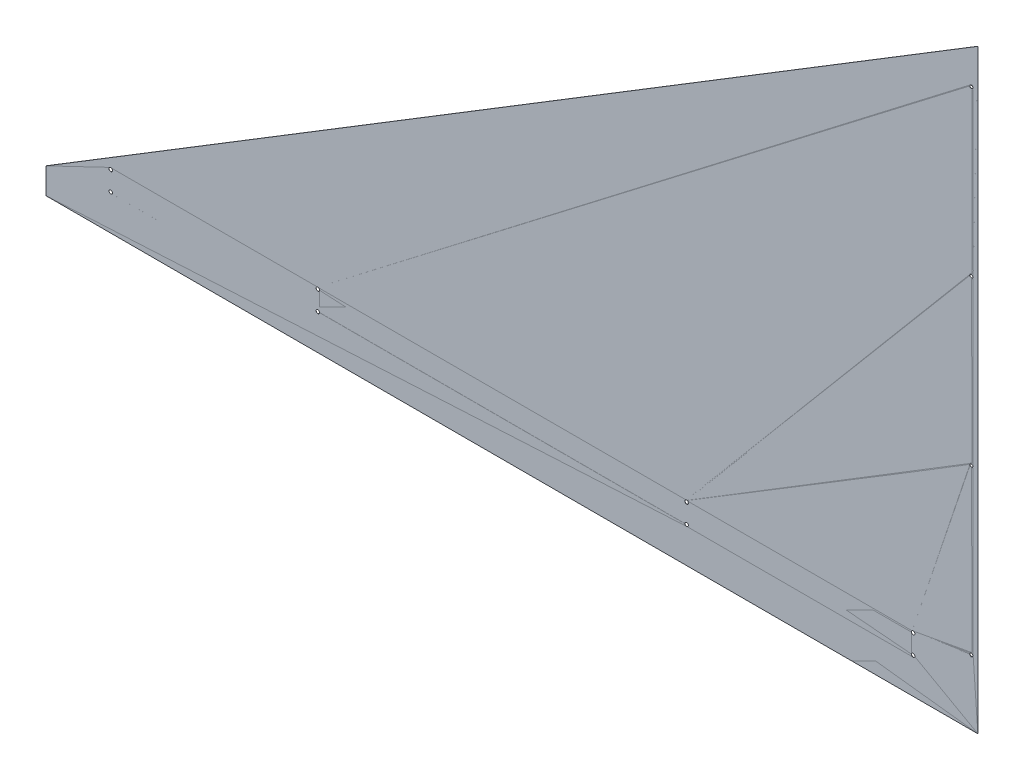
ISO-10303-21;
HEADER;
FILE_DESCRIPTION(('STEP AP214'),'2;1');
FILE_NAME('part.step','',(''),(''),'','','');
FILE_SCHEMA(('AUTOMOTIVE_DESIGN { 1 0 10303 214 1 1 1 1 }'));
ENDSEC;
DATA;
#1=APPLICATION_CONTEXT('core data for automotive mechanical design processes');
#2=APPLICATION_PROTOCOL_DEFINITION('international standard','automotive_design',2000,#1);
#3=PRODUCT_CONTEXT('',#1,'mechanical');
#4=PRODUCT('Part','Part','',(#3));
#5=PRODUCT_RELATED_PRODUCT_CATEGORY('part','',(#4));
#6=PRODUCT_DEFINITION_FORMATION('','',#4);
#7=PRODUCT_DEFINITION_CONTEXT('part definition',#1,'design');
#8=PRODUCT_DEFINITION('design','',#6,#7);
#9=PRODUCT_DEFINITION_SHAPE('','',#8);
#10=(LENGTH_UNIT() NAMED_UNIT(*) SI_UNIT(.MILLI.,.METRE.));
#11=(NAMED_UNIT(*) PLANE_ANGLE_UNIT() SI_UNIT($,.RADIAN.));
#12=(NAMED_UNIT(*) SI_UNIT($,.STERADIAN.) SOLID_ANGLE_UNIT());
#13=UNCERTAINTY_MEASURE_WITH_UNIT(LENGTH_MEASURE(1.E-05),#10,'distance_accuracy_value','');
#14=(GEOMETRIC_REPRESENTATION_CONTEXT(3) GLOBAL_UNCERTAINTY_ASSIGNED_CONTEXT((#13)) GLOBAL_UNIT_ASSIGNED_CONTEXT((#10,
#11,#12)) REPRESENTATION_CONTEXT('',''));
#15=CARTESIAN_POINT('',(0.,0.,0.));
#16=DIRECTION('',(0.,0.,1.));
#17=DIRECTION('',(1.,0.,0.));
#18=AXIS2_PLACEMENT_3D('',#15,#16,#17);
#19=CARTESIAN_POINT('',(0.,0.,0.));
#20=DIRECTION('',(0.,0.,1.));
#21=DIRECTION('',(1.,0.,0.));
#22=AXIS2_PLACEMENT_3D('',#19,#20,#21);
#23=PLANE('',#22);
#24=CARTESIAN_POINT('',(1816.1,77.7875,0.));
#25=DIRECTION('',(0.,0.,-1.));
#26=DIRECTION('',(-1.,0.,0.));
#27=AXIS2_PLACEMENT_3D('',#24,#25,#26);
#28=CIRCLE('',#27,3.3782);
#29=CARTESIAN_POINT('',(1812.7218,77.7875,0.));
#30=VERTEX_POINT('',#29);
#31=EDGE_CURVE('E105',#30,#30,#28,.T.);
#32=ORIENTED_EDGE('',*,*,#31,.F.);
#33=EDGE_LOOP('',(#32));
#34=FACE_BOUND('',#33,.T.);
#35=CARTESIAN_POINT('',(1816.1,399.520833333333,0.));
#36=DIRECTION('',(0.,0.,-1.));
#37=DIRECTION('',(-1.,0.,0.));
#38=AXIS2_PLACEMENT_3D('',#35,#36,#37);
#39=CIRCLE('',#38,3.3782);
#40=CARTESIAN_POINT('',(1812.7218,399.520833333333,0.));
#41=VERTEX_POINT('',#40);
#42=EDGE_CURVE('E113',#41,#41,#39,.T.);
#43=ORIENTED_EDGE('',*,*,#42,.F.);
#44=EDGE_LOOP('',(#43));
#45=FACE_BOUND('',#44,.T.);
#46=CARTESIAN_POINT('',(1816.1,721.254166666667,0.));
#47=DIRECTION('',(0.,0.,-1.));
#48=DIRECTION('',(-1.,0.,0.));
#49=AXIS2_PLACEMENT_3D('',#46,#47,#48);
#50=CIRCLE('',#49,3.3782);
#51=CARTESIAN_POINT('',(1812.7218,721.254166666667,0.));
#52=VERTEX_POINT('',#51);
#53=EDGE_CURVE('E116',#52,#52,#50,.T.);
#54=ORIENTED_EDGE('',*,*,#53,.F.);
#55=EDGE_LOOP('',(#54));
#56=FACE_BOUND('',#55,.T.);
#57=CARTESIAN_POINT('',(1816.1,1042.9875,0.));
#58=DIRECTION('',(0.,0.,-1.));
#59=DIRECTION('',(-1.,0.,0.));
#60=AXIS2_PLACEMENT_3D('',#57,#58,#59);
#61=CIRCLE('',#60,3.3782);
#62=CARTESIAN_POINT('',(1812.7218,1042.9875,0.));
#63=VERTEX_POINT('',#62);
#64=EDGE_CURVE('E119',#63,#63,#61,.T.);
#65=ORIENTED_EDGE('',*,*,#64,.F.);
#66=EDGE_LOOP('',(#65));
#67=FACE_BOUND('',#66,.T.);
#68=CARTESIAN_POINT('',(1701.8,19.05,0.));
#69=DIRECTION('',(0.,0.,-1.));
#70=DIRECTION('',(-1.,0.,0.));
#71=AXIS2_PLACEMENT_3D('',#68,#69,#70);
#72=CIRCLE('',#71,3.3782);
#73=CARTESIAN_POINT('',(1698.4218,19.05,0.));
#74=VERTEX_POINT('',#73);
#75=EDGE_CURVE('E122',#74,#74,#72,.T.);
#76=ORIENTED_EDGE('',*,*,#75,.F.);
#77=EDGE_LOOP('',(#76));
#78=FACE_BOUND('',#77,.T.);
#79=CARTESIAN_POINT('',(1701.8,57.15,0.));
#80=DIRECTION('',(0.,0.,-1.));
#81=DIRECTION('',(-1.,0.,0.));
#82=AXIS2_PLACEMENT_3D('',#79,#80,#81);
#83=CIRCLE('',#82,3.3782);
#84=CARTESIAN_POINT('',(1698.4218,57.15,0.));
#85=VERTEX_POINT('',#84);
#86=EDGE_CURVE('E125',#85,#85,#83,.T.);
#87=ORIENTED_EDGE('',*,*,#86,.F.);
#88=EDGE_LOOP('',(#87));
#89=FACE_BOUND('',#88,.T.);
#90=CARTESIAN_POINT('',(1257.3,57.15,0.));
#91=DIRECTION('',(0.,0.,-1.));
#92=DIRECTION('',(-1.,0.,0.));
#93=AXIS2_PLACEMENT_3D('',#90,#91,#92);
#94=CIRCLE('',#93,3.3782);
#95=CARTESIAN_POINT('',(1253.9218,57.15,0.));
#96=VERTEX_POINT('',#95);
#97=EDGE_CURVE('E128',#96,#96,#94,.T.);
#98=ORIENTED_EDGE('',*,*,#97,.F.);
#99=EDGE_LOOP('',(#98));
#100=FACE_BOUND('',#99,.T.);
#101=CARTESIAN_POINT('',(1257.3,19.05,0.));
#102=DIRECTION('',(0.,0.,-1.));
#103=DIRECTION('',(-1.,0.,0.));
#104=AXIS2_PLACEMENT_3D('',#101,#102,#103);
#105=CIRCLE('',#104,3.3782);
#106=CARTESIAN_POINT('',(1253.9218,19.05,0.));
#107=VERTEX_POINT('',#106);
#108=EDGE_CURVE('E131',#107,#107,#105,.T.);
#109=ORIENTED_EDGE('',*,*,#108,.F.);
#110=EDGE_LOOP('',(#109));
#111=FACE_BOUND('',#110,.T.);
#112=CARTESIAN_POINT('',(533.4,57.15,0.));
#113=DIRECTION('',(0.,0.,-1.));
#114=DIRECTION('',(-1.,0.,0.));
#115=AXIS2_PLACEMENT_3D('',#112,#113,#114);
#116=CIRCLE('',#115,3.3782);
#117=CARTESIAN_POINT('',(530.0218,57.15,0.));
#118=VERTEX_POINT('',#117);
#119=EDGE_CURVE('E134',#118,#118,#116,.T.);
#120=ORIENTED_EDGE('',*,*,#119,.F.);
#121=EDGE_LOOP('',(#120));
#122=FACE_BOUND('',#121,.T.);
#123=CARTESIAN_POINT('',(533.4,19.05,0.));
#124=DIRECTION('',(0.,0.,-1.));
#125=DIRECTION('',(-1.,0.,0.));
#126=AXIS2_PLACEMENT_3D('',#123,#124,#125);
#127=CIRCLE('',#126,3.3782);
#128=CARTESIAN_POINT('',(530.0218,19.05,0.));
#129=VERTEX_POINT('',#128);
#130=EDGE_CURVE('E137',#129,#129,#127,.T.);
#131=ORIENTED_EDGE('',*,*,#130,.F.);
#132=EDGE_LOOP('',(#131));
#133=FACE_BOUND('',#132,.T.);
#134=CARTESIAN_POINT('',(127.,19.05,0.));
#135=DIRECTION('',(0.,0.,-1.));
#136=DIRECTION('',(-1.,0.,0.));
#137=AXIS2_PLACEMENT_3D('',#134,#135,#136);
#138=CIRCLE('',#137,3.3782);
#139=CARTESIAN_POINT('',(123.6218,19.05,0.));
#140=VERTEX_POINT('',#139);
#141=EDGE_CURVE('E143',#140,#140,#138,.T.);
#142=ORIENTED_EDGE('',*,*,#141,.F.);
#143=EDGE_LOOP('',(#142));
#144=FACE_BOUND('',#143,.T.);
#145=DIRECTION('',(0.,1.,0.));
#146=VECTOR('',#145,1.);
#147=CARTESIAN_POINT('',(1828.8,1117.6,0.));
#148=LINE('',#147,#146);
#149=CARTESIAN_POINT('',(1828.8,-50.8,0.));
#150=VERTEX_POINT('',#149);
#151=CARTESIAN_POINT('',(1828.8,1117.6,0.));
#152=VERTEX_POINT('',#151);
#153=EDGE_CURVE('E146',#150,#152,#148,.T.);
#154=ORIENTED_EDGE('',*,*,#153,.F.);
#155=DIRECTION('',(-1.,0.,0.));
#156=VECTOR('',#155,1.);
#157=CARTESIAN_POINT('',(1828.8,-50.8,0.));
#158=LINE('',#157,#156);
#159=CARTESIAN_POINT('',(0.,-50.8,0.));
#160=VERTEX_POINT('',#159);
#161=EDGE_CURVE('E107',#150,#160,#158,.T.);
#162=ORIENTED_EDGE('',*,*,#161,.T.);
#163=DIRECTION('',(0.,1.,0.));
#164=VECTOR('',#163,1.);
#165=CARTESIAN_POINT('',(0.,0.,0.));
#166=LINE('',#165,#164);
#167=CARTESIAN_POINT('',(0.,0.,0.));
#168=VERTEX_POINT('',#167);
#169=EDGE_CURVE('E102',#160,#168,#166,.T.);
#170=ORIENTED_EDGE('',*,*,#169,.T.);
#171=DIRECTION('',(-0.853281833651959,-0.521450009453975,0.));
#172=VECTOR('',#171,1.);
#173=CARTESIAN_POINT('',(0.,0.,0.));
#174=LINE('',#173,#172);
#175=EDGE_CURVE('E148',#152,#168,#174,.T.);
#176=ORIENTED_EDGE('',*,*,#175,.F.);
#177=EDGE_LOOP('',(#154,#162,#170,#176));
#178=FACE_BOUND('',#177,.T.);
#179=CARTESIAN_POINT('',(127.,57.15,0.));
#180=DIRECTION('',(0.,0.,-1.));
#181=DIRECTION('',(-1.,0.,0.));
#182=AXIS2_PLACEMENT_3D('',#179,#180,#181);
#183=CIRCLE('',#182,3.3782);
#184=CARTESIAN_POINT('',(123.6218,57.15,0.));
#185=VERTEX_POINT('',#184);
#186=EDGE_CURVE('E140',#185,#185,#183,.T.);
#187=ORIENTED_EDGE('',*,*,#186,.F.);
#188=EDGE_LOOP('',(#187));
#189=FACE_BOUND('',#188,.T.);
#190=ADVANCED_FACE('F44',(#34,#45,#56,#67,#78,#89,#100,#111,#122,#133,#144,#178,#189),#23,.F.);
#191=CARTESIAN_POINT('',(1828.8,1117.6,3.175));
#192=DIRECTION('',(-1.,0.,0.));
#193=DIRECTION('',(0.,-1.,0.));
#194=AXIS2_PLACEMENT_3D('',#191,#192,#193);
#195=PLANE('',#194);
#196=DIRECTION('',(0.,0.,-1.));
#197=VECTOR('',#196,1.);
#198=CARTESIAN_POINT('',(1828.8,1117.6,3.175));
#199=LINE('',#198,#197);
#200=CARTESIAN_POINT('',(1828.8,1117.6,0.254));
#201=VERTEX_POINT('',#200);
#202=EDGE_CURVE('E12',#201,#152,#199,.T.);
#203=ORIENTED_EDGE('',*,*,#202,.F.);
#204=DIRECTION('',(0.,1.,0.));
#205=VECTOR('',#204,1.);
#206=CARTESIAN_POINT('',(1828.8,-50.8,0.254));
#207=LINE('',#206,#205);
#208=CARTESIAN_POINT('',(1828.8,-50.8,0.254));
#209=VERTEX_POINT('',#208);
#210=EDGE_CURVE('E89',#209,#201,#207,.T.);
#211=ORIENTED_EDGE('',*,*,#210,.F.);
#212=DIRECTION('',(0.,0.,-1.));
#213=VECTOR('',#212,1.);
#214=CARTESIAN_POINT('',(1828.8,-50.8,1832.6804195055));
#215=LINE('',#214,#213);
#216=EDGE_CURVE('E97',#209,#150,#215,.T.);
#217=ORIENTED_EDGE('',*,*,#216,.T.);
#218=ORIENTED_EDGE('',*,*,#153,.T.);
#219=EDGE_LOOP('',(#203,#211,#217,#218));
#220=FACE_BOUND('',#219,.T.);
#221=ADVANCED_FACE('F46',(#220),#195,.F.);
#222=CARTESIAN_POINT('',(0.,0.,3.175));
#223=DIRECTION('',(0.521450009453975,-0.853281833651959,0.));
#224=DIRECTION('',(0.853281833651959,0.521450009453975,0.));
#225=AXIS2_PLACEMENT_3D('',#222,#223,#224);
#226=PLANE('',#225);
#227=DIRECTION('',(0.,0.,-1.));
#228=VECTOR('',#227,1.);
#229=CARTESIAN_POINT('',(0.,0.,3.175));
#230=LINE('',#229,#228);
#231=CARTESIAN_POINT('',(0.,0.,0.253999999999976));
#232=VERTEX_POINT('',#231);
#233=EDGE_CURVE('E52',#232,#168,#230,.T.);
#234=ORIENTED_EDGE('',*,*,#233,.F.);
#235=DIRECTION('',(0.853281833651959,0.521450009453975,0.));
#236=VECTOR('',#235,1.);
#237=CARTESIAN_POINT('',(0.,0.,0.254));
#238=LINE('',#237,#236);
#239=EDGE_CURVE('E59',#232,#201,#238,.T.);
#240=ORIENTED_EDGE('',*,*,#239,.T.);
#241=ORIENTED_EDGE('',*,*,#202,.T.);
#242=ORIENTED_EDGE('',*,*,#175,.T.);
#243=EDGE_LOOP('',(#234,#240,#241,#242));
#244=FACE_BOUND('',#243,.T.);
#245=ADVANCED_FACE('F150',(#244),#226,.F.);
#246=CARTESIAN_POINT('',(127.,19.05,0.));
#247=DIRECTION('',(0.,0.,-1.));
#248=DIRECTION('',(-1.,0.,0.));
#249=AXIS2_PLACEMENT_3D('',#246,#247,#248);
#250=CYLINDRICAL_SURFACE('',#249,3.3782);
#251=CARTESIAN_POINT('',(127.,19.05,0.254));
#252=DIRECTION('',(0.,0.,-1.));
#253=DIRECTION('',(-1.,0.,0.));
#254=AXIS2_PLACEMENT_3D('',#251,#252,#253);
#255=CIRCLE('',#254,3.3782);
#256=CARTESIAN_POINT('',(123.6218,19.05,0.254));
#257=VERTEX_POINT('',#256);
#258=EDGE_CURVE('E154',#257,#257,#255,.F.);
#259=ORIENTED_EDGE('',*,*,#258,.T.);
#260=EDGE_LOOP('',(#259));
#261=FACE_BOUND('',#260,.T.);
#262=ORIENTED_EDGE('',*,*,#141,.T.);
#263=EDGE_LOOP('',(#262));
#264=FACE_BOUND('',#263,.T.);
#265=ADVANCED_FACE('F197',(#261,#264),#250,.F.);
#266=CARTESIAN_POINT('',(127.,57.15,0.));
#267=DIRECTION('',(0.,0.,-1.));
#268=DIRECTION('',(-1.,0.,0.));
#269=AXIS2_PLACEMENT_3D('',#266,#267,#268);
#270=CYLINDRICAL_SURFACE('',#269,3.3782);
#271=CARTESIAN_POINT('',(127.,57.15,0.254));
#272=DIRECTION('',(0.,0.,-1.));
#273=DIRECTION('',(-1.,0.,0.));
#274=AXIS2_PLACEMENT_3D('',#271,#272,#273);
#275=CIRCLE('',#274,3.3782);
#276=CARTESIAN_POINT('',(123.6218,57.15,0.254));
#277=VERTEX_POINT('',#276);
#278=EDGE_CURVE('E157',#277,#277,#275,.F.);
#279=ORIENTED_EDGE('',*,*,#278,.T.);
#280=EDGE_LOOP('',(#279));
#281=FACE_BOUND('',#280,.T.);
#282=ORIENTED_EDGE('',*,*,#186,.T.);
#283=EDGE_LOOP('',(#282));
#284=FACE_BOUND('',#283,.T.);
#285=ADVANCED_FACE('F207',(#281,#284),#270,.F.);
#286=CARTESIAN_POINT('',(533.4,19.05,0.));
#287=DIRECTION('',(0.,0.,-1.));
#288=DIRECTION('',(-1.,0.,0.));
#289=AXIS2_PLACEMENT_3D('',#286,#287,#288);
#290=CYLINDRICAL_SURFACE('',#289,3.3782);
#291=CARTESIAN_POINT('',(533.4,19.05,0.254));
#292=DIRECTION('',(0.,0.,-1.));
#293=DIRECTION('',(-1.,0.,0.));
#294=AXIS2_PLACEMENT_3D('',#291,#292,#293);
#295=CIRCLE('',#294,3.3782);
#296=CARTESIAN_POINT('',(530.0218,19.05,0.254));
#297=VERTEX_POINT('',#296);
#298=EDGE_CURVE('E162',#297,#297,#295,.F.);
#299=ORIENTED_EDGE('',*,*,#298,.T.);
#300=EDGE_LOOP('',(#299));
#301=FACE_BOUND('',#300,.T.);
#302=ORIENTED_EDGE('',*,*,#130,.T.);
#303=EDGE_LOOP('',(#302));
#304=FACE_BOUND('',#303,.T.);
#305=ADVANCED_FACE('F211',(#301,#304),#290,.F.);
#306=CARTESIAN_POINT('',(533.4,57.15,0.));
#307=DIRECTION('',(0.,0.,-1.));
#308=DIRECTION('',(-1.,0.,0.));
#309=AXIS2_PLACEMENT_3D('',#306,#307,#308);
#310=CYLINDRICAL_SURFACE('',#309,3.3782);
#311=CARTESIAN_POINT('',(533.4,57.15,0.254));
#312=DIRECTION('',(0.,0.,-1.));
#313=DIRECTION('',(-1.,0.,0.));
#314=AXIS2_PLACEMENT_3D('',#311,#312,#313);
#315=CIRCLE('',#314,3.3782);
#316=CARTESIAN_POINT('',(530.0218,57.15,0.254));
#317=VERTEX_POINT('',#316);
#318=EDGE_CURVE('E165',#317,#317,#315,.F.);
#319=ORIENTED_EDGE('',*,*,#318,.T.);
#320=EDGE_LOOP('',(#319));
#321=FACE_BOUND('',#320,.T.);
#322=ORIENTED_EDGE('',*,*,#119,.T.);
#323=EDGE_LOOP('',(#322));
#324=FACE_BOUND('',#323,.T.);
#325=ADVANCED_FACE('F215',(#321,#324),#310,.F.);
#326=CARTESIAN_POINT('',(1257.3,19.05,0.));
#327=DIRECTION('',(0.,0.,-1.));
#328=DIRECTION('',(-1.,0.,0.));
#329=AXIS2_PLACEMENT_3D('',#326,#327,#328);
#330=CYLINDRICAL_SURFACE('',#329,3.3782);
#331=CARTESIAN_POINT('',(1257.3,19.05,0.254));
#332=DIRECTION('',(0.,0.,-1.));
#333=DIRECTION('',(-1.,0.,0.));
#334=AXIS2_PLACEMENT_3D('',#331,#332,#333);
#335=CIRCLE('',#334,3.3782);
#336=CARTESIAN_POINT('',(1253.9218,19.05,0.254));
#337=VERTEX_POINT('',#336);
#338=EDGE_CURVE('E168',#337,#337,#335,.F.);
#339=ORIENTED_EDGE('',*,*,#338,.T.);
#340=EDGE_LOOP('',(#339));
#341=FACE_BOUND('',#340,.T.);
#342=ORIENTED_EDGE('',*,*,#108,.T.);
#343=EDGE_LOOP('',(#342));
#344=FACE_BOUND('',#343,.T.);
#345=ADVANCED_FACE('F219',(#341,#344),#330,.F.);
#346=CARTESIAN_POINT('',(1257.3,57.15,0.));
#347=DIRECTION('',(0.,0.,-1.));
#348=DIRECTION('',(-1.,0.,0.));
#349=AXIS2_PLACEMENT_3D('',#346,#347,#348);
#350=CYLINDRICAL_SURFACE('',#349,3.3782);
#351=CARTESIAN_POINT('',(1257.3,57.15,0.254));
#352=DIRECTION('',(0.,0.,-1.));
#353=DIRECTION('',(-1.,0.,0.));
#354=AXIS2_PLACEMENT_3D('',#351,#352,#353);
#355=CIRCLE('',#354,3.3782);
#356=CARTESIAN_POINT('',(1253.9218,57.15,0.254));
#357=VERTEX_POINT('',#356);
#358=EDGE_CURVE('E171',#357,#357,#355,.F.);
#359=ORIENTED_EDGE('',*,*,#358,.T.);
#360=EDGE_LOOP('',(#359));
#361=FACE_BOUND('',#360,.T.);
#362=ORIENTED_EDGE('',*,*,#97,.T.);
#363=EDGE_LOOP('',(#362));
#364=FACE_BOUND('',#363,.T.);
#365=ADVANCED_FACE('F223',(#361,#364),#350,.F.);
#366=CARTESIAN_POINT('',(1701.8,57.15,0.));
#367=DIRECTION('',(0.,0.,-1.));
#368=DIRECTION('',(-1.,0.,0.));
#369=AXIS2_PLACEMENT_3D('',#366,#367,#368);
#370=CYLINDRICAL_SURFACE('',#369,3.3782);
#371=CARTESIAN_POINT('',(1701.8,57.15,0.254));
#372=DIRECTION('',(0.,0.,-1.));
#373=DIRECTION('',(-1.,0.,0.));
#374=AXIS2_PLACEMENT_3D('',#371,#372,#373);
#375=CIRCLE('',#374,3.3782);
#376=CARTESIAN_POINT('',(1698.4218,57.15,0.254));
#377=VERTEX_POINT('',#376);
#378=EDGE_CURVE('E174',#377,#377,#375,.F.);
#379=ORIENTED_EDGE('',*,*,#378,.T.);
#380=EDGE_LOOP('',(#379));
#381=FACE_BOUND('',#380,.T.);
#382=ORIENTED_EDGE('',*,*,#86,.T.);
#383=EDGE_LOOP('',(#382));
#384=FACE_BOUND('',#383,.T.);
#385=ADVANCED_FACE('F227',(#381,#384),#370,.F.);
#386=CARTESIAN_POINT('',(1701.8,19.05,0.));
#387=DIRECTION('',(0.,0.,-1.));
#388=DIRECTION('',(-1.,0.,0.));
#389=AXIS2_PLACEMENT_3D('',#386,#387,#388);
#390=CYLINDRICAL_SURFACE('',#389,3.3782);
#391=CARTESIAN_POINT('',(1701.8,19.05,0.254));
#392=DIRECTION('',(0.,0.,-1.));
#393=DIRECTION('',(-1.,0.,0.));
#394=AXIS2_PLACEMENT_3D('',#391,#392,#393);
#395=CIRCLE('',#394,3.3782);
#396=CARTESIAN_POINT('',(1698.4218,19.05,0.254));
#397=VERTEX_POINT('',#396);
#398=EDGE_CURVE('E177',#397,#397,#395,.F.);
#399=ORIENTED_EDGE('',*,*,#398,.T.);
#400=EDGE_LOOP('',(#399));
#401=FACE_BOUND('',#400,.T.);
#402=ORIENTED_EDGE('',*,*,#75,.T.);
#403=EDGE_LOOP('',(#402));
#404=FACE_BOUND('',#403,.T.);
#405=ADVANCED_FACE('F231',(#401,#404),#390,.F.);
#406=CARTESIAN_POINT('',(1816.1,1042.9875,0.));
#407=DIRECTION('',(0.,0.,-1.));
#408=DIRECTION('',(-1.,0.,0.));
#409=AXIS2_PLACEMENT_3D('',#406,#407,#408);
#410=CYLINDRICAL_SURFACE('',#409,3.3782);
#411=CARTESIAN_POINT('',(1816.1,1042.9875,0.254));
#412=DIRECTION('',(0.,0.,-1.));
#413=DIRECTION('',(-1.,0.,0.));
#414=AXIS2_PLACEMENT_3D('',#411,#412,#413);
#415=CIRCLE('',#414,3.3782);
#416=CARTESIAN_POINT('',(1812.7218,1042.9875,0.254));
#417=VERTEX_POINT('',#416);
#418=EDGE_CURVE('E180',#417,#417,#415,.F.);
#419=ORIENTED_EDGE('',*,*,#418,.T.);
#420=EDGE_LOOP('',(#419));
#421=FACE_BOUND('',#420,.T.);
#422=ORIENTED_EDGE('',*,*,#64,.T.);
#423=EDGE_LOOP('',(#422));
#424=FACE_BOUND('',#423,.T.);
#425=ADVANCED_FACE('F235',(#421,#424),#410,.F.);
#426=CARTESIAN_POINT('',(1816.1,721.254166666667,0.));
#427=DIRECTION('',(0.,0.,-1.));
#428=DIRECTION('',(-1.,0.,0.));
#429=AXIS2_PLACEMENT_3D('',#426,#427,#428);
#430=CYLINDRICAL_SURFACE('',#429,3.3782);
#431=CARTESIAN_POINT('',(1816.1,721.254166666667,0.254));
#432=DIRECTION('',(0.,0.,-1.));
#433=DIRECTION('',(-1.,0.,0.));
#434=AXIS2_PLACEMENT_3D('',#431,#432,#433);
#435=CIRCLE('',#434,3.3782);
#436=CARTESIAN_POINT('',(1812.7218,721.254166666667,0.254));
#437=VERTEX_POINT('',#436);
#438=EDGE_CURVE('E183',#437,#437,#435,.F.);
#439=ORIENTED_EDGE('',*,*,#438,.T.);
#440=EDGE_LOOP('',(#439));
#441=FACE_BOUND('',#440,.T.);
#442=ORIENTED_EDGE('',*,*,#53,.T.);
#443=EDGE_LOOP('',(#442));
#444=FACE_BOUND('',#443,.T.);
#445=ADVANCED_FACE('F239',(#441,#444),#430,.F.);
#446=CARTESIAN_POINT('',(1816.1,399.520833333333,0.));
#447=DIRECTION('',(0.,0.,-1.));
#448=DIRECTION('',(-1.,0.,0.));
#449=AXIS2_PLACEMENT_3D('',#446,#447,#448);
#450=CYLINDRICAL_SURFACE('',#449,3.3782);
#451=CARTESIAN_POINT('',(1816.1,399.520833333333,0.254));
#452=DIRECTION('',(0.,0.,-1.));
#453=DIRECTION('',(-1.,0.,0.));
#454=AXIS2_PLACEMENT_3D('',#451,#452,#453);
#455=CIRCLE('',#454,3.3782);
#456=CARTESIAN_POINT('',(1812.7218,399.520833333333,0.254));
#457=VERTEX_POINT('',#456);
#458=EDGE_CURVE('E186',#457,#457,#455,.F.);
#459=ORIENTED_EDGE('',*,*,#458,.T.);
#460=EDGE_LOOP('',(#459));
#461=FACE_BOUND('',#460,.T.);
#462=ORIENTED_EDGE('',*,*,#42,.T.);
#463=EDGE_LOOP('',(#462));
#464=FACE_BOUND('',#463,.T.);
#465=ADVANCED_FACE('F243',(#461,#464),#450,.F.);
#466=CARTESIAN_POINT('',(1816.1,77.7875,0.));
#467=DIRECTION('',(0.,0.,-1.));
#468=DIRECTION('',(-1.,0.,0.));
#469=AXIS2_PLACEMENT_3D('',#466,#467,#468);
#470=CYLINDRICAL_SURFACE('',#469,3.3782);
#471=CARTESIAN_POINT('',(1816.1,77.7875,0.254));
#472=DIRECTION('',(0.,0.,-1.));
#473=DIRECTION('',(-1.,0.,0.));
#474=AXIS2_PLACEMENT_3D('',#471,#472,#473);
#475=CIRCLE('',#474,3.3782);
#476=CARTESIAN_POINT('',(1812.7218,77.7875,0.254));
#477=VERTEX_POINT('',#476);
#478=EDGE_CURVE('E98',#477,#477,#475,.F.);
#479=ORIENTED_EDGE('',*,*,#478,.T.);
#480=EDGE_LOOP('',(#479));
#481=FACE_BOUND('',#480,.T.);
#482=ORIENTED_EDGE('',*,*,#31,.T.);
#483=EDGE_LOOP('',(#482));
#484=FACE_BOUND('',#483,.T.);
#485=ADVANCED_FACE('F247',(#481,#484),#470,.F.);
#486=CARTESIAN_POINT('',(1828.8,-50.8,1832.6804195055));
#487=DIRECTION('',(0.,-1.,0.));
#488=DIRECTION('',(0.,0.,-1.));
#489=AXIS2_PLACEMENT_3D('',#486,#487,#488);
#490=PLANE('',#489);
#491=DIRECTION('',(1.,0.,0.));
#492=VECTOR('',#491,1.);
#493=CARTESIAN_POINT('',(0.,-50.8000000000007,0.254));
#494=LINE('',#493,#492);
#495=CARTESIAN_POINT('',(0.,-50.8000000000007,0.254));
#496=VERTEX_POINT('',#495);
#497=EDGE_CURVE('E84',#496,#209,#494,.T.);
#498=ORIENTED_EDGE('',*,*,#497,.F.);
#499=DIRECTION('',(0.,0.,-1.));
#500=VECTOR('',#499,1.);
#501=CARTESIAN_POINT('',(0.,-50.8,1832.6804195055));
#502=LINE('',#501,#500);
#503=EDGE_CURVE('E95',#496,#160,#502,.T.);
#504=ORIENTED_EDGE('',*,*,#503,.T.);
#505=ORIENTED_EDGE('',*,*,#161,.F.);
#506=ORIENTED_EDGE('',*,*,#216,.F.);
#507=EDGE_LOOP('',(#498,#504,#505,#506));
#508=FACE_BOUND('',#507,.T.);
#509=ADVANCED_FACE('F93',(#508),#490,.T.);
#510=CARTESIAN_POINT('',(0.,0.,1832.6804195055));
#511=DIRECTION('',(-1.,0.,0.));
#512=DIRECTION('',(0.,0.,1.));
#513=AXIS2_PLACEMENT_3D('',#510,#511,#512);
#514=PLANE('',#513);
#515=DIRECTION('',(0.,1.,0.));
#516=VECTOR('',#515,1.);
#517=CARTESIAN_POINT('',(0.,-50.8000000000007,0.254));
#518=LINE('',#517,#516);
#519=EDGE_CURVE('E81',#496,#232,#518,.T.);
#520=ORIENTED_EDGE('',*,*,#519,.T.);
#521=ORIENTED_EDGE('',*,*,#233,.T.);
#522=ORIENTED_EDGE('',*,*,#169,.F.);
#523=ORIENTED_EDGE('',*,*,#503,.F.);
#524=EDGE_LOOP('',(#520,#521,#522,#523));
#525=FACE_BOUND('',#524,.T.);
#526=ADVANCED_FACE('F100',(#525),#514,.T.);
#527=CARTESIAN_POINT('',(0.,-50.8000000000007,0.254));
#528=DIRECTION('',(0.,0.,-1.));
#529=DIRECTION('',(-1.,0.,0.));
#530=AXIS2_PLACEMENT_3D('',#527,#528,#529);
#531=PLANE('',#530);
#532=ORIENTED_EDGE('',*,*,#278,.F.);
#533=EDGE_LOOP('',(#532));
#534=FACE_BOUND('',#533,.T.);
#535=ORIENTED_EDGE('',*,*,#318,.F.);
#536=EDGE_LOOP('',(#535));
#537=FACE_BOUND('',#536,.T.);
#538=ORIENTED_EDGE('',*,*,#358,.F.);
#539=EDGE_LOOP('',(#538));
#540=FACE_BOUND('',#539,.T.);
#541=ORIENTED_EDGE('',*,*,#398,.F.);
#542=EDGE_LOOP('',(#541));
#543=FACE_BOUND('',#542,.T.);
#544=ORIENTED_EDGE('',*,*,#438,.F.);
#545=EDGE_LOOP('',(#544));
#546=FACE_BOUND('',#545,.T.);
#547=ORIENTED_EDGE('',*,*,#478,.F.);
#548=EDGE_LOOP('',(#547));
#549=FACE_BOUND('',#548,.T.);
#550=ORIENTED_EDGE('',*,*,#458,.F.);
#551=EDGE_LOOP('',(#550));
#552=FACE_BOUND('',#551,.T.);
#553=ORIENTED_EDGE('',*,*,#418,.F.);
#554=EDGE_LOOP('',(#553));
#555=FACE_BOUND('',#554,.T.);
#556=ORIENTED_EDGE('',*,*,#378,.F.);
#557=EDGE_LOOP('',(#556));
#558=FACE_BOUND('',#557,.T.);
#559=ORIENTED_EDGE('',*,*,#338,.F.);
#560=EDGE_LOOP('',(#559));
#561=FACE_BOUND('',#560,.T.);
#562=ORIENTED_EDGE('',*,*,#298,.F.);
#563=EDGE_LOOP('',(#562));
#564=FACE_BOUND('',#563,.T.);
#565=ORIENTED_EDGE('',*,*,#258,.F.);
#566=EDGE_LOOP('',(#565));
#567=FACE_BOUND('',#566,.T.);
#568=ORIENTED_EDGE('',*,*,#519,.F.);
#569=ORIENTED_EDGE('',*,*,#497,.T.);
#570=ORIENTED_EDGE('',*,*,#210,.T.);
#571=ORIENTED_EDGE('',*,*,#239,.F.);
#572=EDGE_LOOP('',(#568,#569,#570,#571));
#573=FACE_BOUND('',#572,.T.);
#574=ADVANCED_FACE('F83',(#534,#537,#540,#543,#546,#549,#552,#555,#558,#561,#564,#567,#573),
#531,.F.);
#575=CLOSED_SHELL('',(#190,#221,#245,#265,#285,#305,#325,#345,#365,#385,#405,#425,#445,#465,
#485,#509,#526,#574));
#576=MANIFOLD_SOLID_BREP('B2',#575);
#577=CARTESIAN_POINT('',(0.,0.,0.));
#578=DIRECTION('',(0.,0.,1.));
#579=DIRECTION('',(1.,0.,0.));
#580=AXIS2_PLACEMENT_3D('',#577,#578,#579);
#581=PLANE('',#580);
#582=CARTESIAN_POINT('',(1816.1,397.933333333333,0.));
#583=DIRECTION('',(0.,0.,-1.));
#584=DIRECTION('',(-1.,0.,0.));
#585=AXIS2_PLACEMENT_3D('',#582,#583,#584);
#586=CIRCLE('',#585,3.3782);
#587=CARTESIAN_POINT('',(1812.7218,397.933333333333,0.));
#588=VERTEX_POINT('',#587);
#589=EDGE_CURVE('E494',#588,#588,#586,.T.);
#590=ORIENTED_EDGE('',*,*,#589,.F.);
#591=EDGE_LOOP('',(#590));
#592=FACE_BOUND('',#591,.T.);
#593=CARTESIAN_POINT('',(1816.1,719.666666666666,0.));
#594=DIRECTION('',(0.,0.,-1.));
#595=DIRECTION('',(-1.,0.,0.));
#596=AXIS2_PLACEMENT_3D('',#593,#594,#595);
#597=CIRCLE('',#596,3.3782);
#598=CARTESIAN_POINT('',(1812.7218,719.666666666666,0.));
#599=VERTEX_POINT('',#598);
#600=EDGE_CURVE('E497',#599,#599,#597,.T.);
#601=ORIENTED_EDGE('',*,*,#600,.F.);
#602=EDGE_LOOP('',(#601));
#603=FACE_BOUND('',#602,.T.);
#604=CARTESIAN_POINT('',(1816.1,1041.4,0.));
#605=DIRECTION('',(0.,0.,-1.));
#606=DIRECTION('',(-1.,0.,0.));
#607=AXIS2_PLACEMENT_3D('',#604,#605,#606);
#608=CIRCLE('',#607,3.3782);
#609=CARTESIAN_POINT('',(1812.7218,1041.4,0.));
#610=VERTEX_POINT('',#609);
#611=EDGE_CURVE('E500',#610,#610,#608,.T.);
#612=ORIENTED_EDGE('',*,*,#611,.F.);
#613=EDGE_LOOP('',(#612));
#614=FACE_BOUND('',#613,.T.);
#615=CARTESIAN_POINT('',(1701.8,57.15,0.));
#616=DIRECTION('',(0.,0.,-1.));
#617=DIRECTION('',(-1.,0.,0.));
#618=AXIS2_PLACEMENT_3D('',#615,#616,#617);
#619=CIRCLE('',#618,3.3782);
#620=CARTESIAN_POINT('',(1698.4218,57.15,0.));
#621=VERTEX_POINT('',#620);
#622=EDGE_CURVE('E506',#621,#621,#619,.T.);
#623=ORIENTED_EDGE('',*,*,#622,.F.);
#624=EDGE_LOOP('',(#623));
#625=FACE_BOUND('',#624,.T.);
#626=CARTESIAN_POINT('',(1257.3,57.15,0.));
#627=DIRECTION('',(0.,0.,-1.));
#628=DIRECTION('',(-1.,0.,0.));
#629=AXIS2_PLACEMENT_3D('',#626,#627,#628);
#630=CIRCLE('',#629,3.3782);
#631=CARTESIAN_POINT('',(1253.9218,57.15,0.));
#632=VERTEX_POINT('',#631);
#633=EDGE_CURVE('E509',#632,#632,#630,.T.);
#634=ORIENTED_EDGE('',*,*,#633,.F.);
#635=EDGE_LOOP('',(#634));
#636=FACE_BOUND('',#635,.T.);
#637=CARTESIAN_POINT('',(1257.3,19.05,0.));
#638=DIRECTION('',(0.,0.,-1.));
#639=DIRECTION('',(-1.,0.,0.));
#640=AXIS2_PLACEMENT_3D('',#637,#638,#639);
#641=CIRCLE('',#640,3.3782);
#642=CARTESIAN_POINT('',(1253.9218,19.05,0.));
#643=VERTEX_POINT('',#642);
#644=EDGE_CURVE('E512',#643,#643,#641,.T.);
#645=ORIENTED_EDGE('',*,*,#644,.F.);
#646=EDGE_LOOP('',(#645));
#647=FACE_BOUND('',#646,.T.);
#648=CARTESIAN_POINT('',(533.4,57.15,0.));
#649=DIRECTION('',(0.,0.,-1.));
#650=DIRECTION('',(-1.,0.,0.));
#651=AXIS2_PLACEMENT_3D('',#648,#649,#650);
#652=CIRCLE('',#651,3.3782);
#653=CARTESIAN_POINT('',(530.0218,57.15,0.));
#654=VERTEX_POINT('',#653);
#655=EDGE_CURVE('E515',#654,#654,#652,.T.);
#656=ORIENTED_EDGE('',*,*,#655,.F.);
#657=EDGE_LOOP('',(#656));
#658=FACE_BOUND('',#657,.T.);
#659=CARTESIAN_POINT('',(533.4,19.05,0.));
#660=DIRECTION('',(0.,0.,-1.));
#661=DIRECTION('',(-1.,0.,0.));
#662=AXIS2_PLACEMENT_3D('',#659,#660,#661);
#663=CIRCLE('',#662,3.3782);
#664=CARTESIAN_POINT('',(530.0218,19.05,0.));
#665=VERTEX_POINT('',#664);
#666=EDGE_CURVE('E518',#665,#665,#663,.T.);
#667=ORIENTED_EDGE('',*,*,#666,.F.);
#668=EDGE_LOOP('',(#667));
#669=FACE_BOUND('',#668,.T.);
#670=CARTESIAN_POINT('',(127.,57.15,0.));
#671=DIRECTION('',(0.,0.,-1.));
#672=DIRECTION('',(-1.,0.,0.));
#673=AXIS2_PLACEMENT_3D('',#670,#671,#672);
#674=CIRCLE('',#673,3.3782);
#675=CARTESIAN_POINT('',(123.6218,57.15,0.));
#676=VERTEX_POINT('',#675);
#677=EDGE_CURVE('E521',#676,#676,#674,.T.);
#678=ORIENTED_EDGE('',*,*,#677,.F.);
#679=EDGE_LOOP('',(#678));
#680=FACE_BOUND('',#679,.T.);
#681=CARTESIAN_POINT('',(127.,19.05,0.));
#682=DIRECTION('',(0.,0.,-1.));
#683=DIRECTION('',(-1.,0.,0.));
#684=AXIS2_PLACEMENT_3D('',#681,#682,#683);
#685=CIRCLE('',#684,3.3782);
#686=CARTESIAN_POINT('',(123.6218,19.05,0.));
#687=VERTEX_POINT('',#686);
#688=EDGE_CURVE('E524',#687,#687,#685,.T.);
#689=ORIENTED_EDGE('',*,*,#688,.F.);
#690=EDGE_LOOP('',(#689));
#691=FACE_BOUND('',#690,.T.);
#692=DIRECTION('',(0.,1.,0.));
#693=VECTOR('',#692,1.);
#694=CARTESIAN_POINT('',(1828.8,1117.6,0.));
#695=LINE('',#694,#693);
#696=CARTESIAN_POINT('',(1828.8,-50.8,0.));
#697=VERTEX_POINT('',#696);
#698=CARTESIAN_POINT('',(1828.8,1117.6,0.));
#699=VERTEX_POINT('',#698);
#700=EDGE_CURVE('E527',#697,#699,#695,.T.);
#701=ORIENTED_EDGE('',*,*,#700,.F.);
#702=DIRECTION('',(-1.,0.,0.));
#703=VECTOR('',#702,1.);
#704=CARTESIAN_POINT('',(1828.8,-50.8,0.));
#705=LINE('',#704,#703);
#706=CARTESIAN_POINT('',(0.,-50.8,0.));
#707=VERTEX_POINT('',#706);
#708=EDGE_CURVE('E488',#697,#707,#705,.T.);
#709=ORIENTED_EDGE('',*,*,#708,.T.);
#710=DIRECTION('',(0.,1.,0.));
#711=VECTOR('',#710,1.);
#712=CARTESIAN_POINT('',(0.,0.,0.));
#713=LINE('',#712,#711);
#714=CARTESIAN_POINT('',(0.,0.,0.));
#715=VERTEX_POINT('',#714);
#716=EDGE_CURVE('E483',#707,#715,#713,.T.);
#717=ORIENTED_EDGE('',*,*,#716,.T.);
#718=DIRECTION('',(-0.853281833651959,-0.521450009453975,0.));
#719=VECTOR('',#718,1.);
#720=CARTESIAN_POINT('',(0.,0.,0.));
#721=LINE('',#720,#719);
#722=EDGE_CURVE('E529',#699,#715,#721,.T.);
#723=ORIENTED_EDGE('',*,*,#722,.F.);
#724=EDGE_LOOP('',(#701,#709,#717,#723));
#725=FACE_BOUND('',#724,.T.);
#726=CARTESIAN_POINT('',(1701.8,19.05,0.));
#727=DIRECTION('',(0.,0.,-1.));
#728=DIRECTION('',(-1.,0.,0.));
#729=AXIS2_PLACEMENT_3D('',#726,#727,#728);
#730=CIRCLE('',#729,3.3782);
#731=CARTESIAN_POINT('',(1698.4218,19.05,0.));
#732=VERTEX_POINT('',#731);
#733=EDGE_CURVE('E503',#732,#732,#730,.T.);
#734=ORIENTED_EDGE('',*,*,#733,.F.);
#735=EDGE_LOOP('',(#734));
#736=FACE_BOUND('',#735,.T.);
#737=CARTESIAN_POINT('',(1816.1,76.2,0.));
#738=DIRECTION('',(0.,0.,-1.));
#739=DIRECTION('',(-1.,0.,0.));
#740=AXIS2_PLACEMENT_3D('',#737,#738,#739);
#741=CIRCLE('',#740,3.3782);
#742=CARTESIAN_POINT('',(1812.7218,76.2,0.));
#743=VERTEX_POINT('',#742);
#744=EDGE_CURVE('E486',#743,#743,#741,.T.);
#745=ORIENTED_EDGE('',*,*,#744,.F.);
#746=EDGE_LOOP('',(#745));
#747=FACE_BOUND('',#746,.T.);
#748=ADVANCED_FACE('F425',(#592,#603,#614,#625,#636,#647,#658,#669,#680,#691,#725,#736,#747),
#581,.F.);
#749=CARTESIAN_POINT('',(1828.8,1117.6,3.175));
#750=DIRECTION('',(-1.,0.,0.));
#751=DIRECTION('',(0.,-1.,0.));
#752=AXIS2_PLACEMENT_3D('',#749,#750,#751);
#753=PLANE('',#752);
#754=DIRECTION('',(0.,0.,-1.));
#755=VECTOR('',#754,1.);
#756=CARTESIAN_POINT('',(1828.8,1117.6,3.175));
#757=LINE('',#756,#755);
#758=CARTESIAN_POINT('',(1828.8,1117.6,0.254));
#759=VERTEX_POINT('',#758);
#760=EDGE_CURVE('E42',#759,#699,#757,.T.);
#761=ORIENTED_EDGE('',*,*,#760,.F.);
#762=DIRECTION('',(0.,1.,0.));
#763=VECTOR('',#762,1.);
#764=CARTESIAN_POINT('',(1828.8,-50.8,0.254));
#765=LINE('',#764,#763);
#766=CARTESIAN_POINT('',(1828.8,-50.8,0.254));
#767=VERTEX_POINT('',#766);
#768=EDGE_CURVE('E470',#767,#759,#765,.T.);
#769=ORIENTED_EDGE('',*,*,#768,.F.);
#770=DIRECTION('',(0.,0.,-1.));
#771=VECTOR('',#770,1.);
#772=CARTESIAN_POINT('',(1828.8,-50.8,1832.6804195055));
#773=LINE('',#772,#771);
#774=EDGE_CURVE('E478',#767,#697,#773,.T.);
#775=ORIENTED_EDGE('',*,*,#774,.T.);
#776=ORIENTED_EDGE('',*,*,#700,.T.);
#777=EDGE_LOOP('',(#761,#769,#775,#776));
#778=FACE_BOUND('',#777,.T.);
#779=ADVANCED_FACE('F427',(#778),#753,.F.);
#780=CARTESIAN_POINT('',(0.,0.,3.175));
#781=DIRECTION('',(0.521450009453975,-0.853281833651959,0.));
#782=DIRECTION('',(0.853281833651959,0.521450009453975,0.));
#783=AXIS2_PLACEMENT_3D('',#780,#781,#782);
#784=PLANE('',#783);
#785=DIRECTION('',(0.,0.,-1.));
#786=VECTOR('',#785,1.);
#787=CARTESIAN_POINT('',(0.,0.,3.175));
#788=LINE('',#787,#786);
#789=CARTESIAN_POINT('',(0.,0.,0.253999999999976));
#790=VERTEX_POINT('',#789);
#791=EDGE_CURVE('E433',#790,#715,#788,.T.);
#792=ORIENTED_EDGE('',*,*,#791,.F.);
#793=DIRECTION('',(0.853281833651959,0.521450009453975,0.));
#794=VECTOR('',#793,1.);
#795=CARTESIAN_POINT('',(0.,0.,0.254));
#796=LINE('',#795,#794);
#797=EDGE_CURVE('E440',#790,#759,#796,.T.);
#798=ORIENTED_EDGE('',*,*,#797,.T.);
#799=ORIENTED_EDGE('',*,*,#760,.T.);
#800=ORIENTED_EDGE('',*,*,#722,.T.);
#801=EDGE_LOOP('',(#792,#798,#799,#800));
#802=FACE_BOUND('',#801,.T.);
#803=ADVANCED_FACE('F531',(#802),#784,.F.);
#804=CARTESIAN_POINT('',(127.,19.05,0.));
#805=DIRECTION('',(0.,0.,-1.));
#806=DIRECTION('',(-1.,0.,0.));
#807=AXIS2_PLACEMENT_3D('',#804,#805,#806);
#808=CYLINDRICAL_SURFACE('',#807,3.3782);
#809=CARTESIAN_POINT('',(127.,19.05,0.254));
#810=DIRECTION('',(0.,0.,-1.));
#811=DIRECTION('',(-1.,0.,0.));
#812=AXIS2_PLACEMENT_3D('',#809,#810,#811);
#813=CIRCLE('',#812,3.3782);
#814=CARTESIAN_POINT('',(123.6218,19.05,0.254));
#815=VERTEX_POINT('',#814);
#816=EDGE_CURVE('E535',#815,#815,#813,.F.);
#817=ORIENTED_EDGE('',*,*,#816,.T.);
#818=EDGE_LOOP('',(#817));
#819=FACE_BOUND('',#818,.T.);
#820=ORIENTED_EDGE('',*,*,#688,.T.);
#821=EDGE_LOOP('',(#820));
#822=FACE_BOUND('',#821,.T.);
#823=ADVANCED_FACE('F578',(#819,#822),#808,.F.);
#824=CARTESIAN_POINT('',(127.,57.15,0.));
#825=DIRECTION('',(0.,0.,-1.));
#826=DIRECTION('',(-1.,0.,0.));
#827=AXIS2_PLACEMENT_3D('',#824,#825,#826);
#828=CYLINDRICAL_SURFACE('',#827,3.3782);
#829=CARTESIAN_POINT('',(127.,57.15,0.254));
#830=DIRECTION('',(0.,0.,-1.));
#831=DIRECTION('',(-1.,0.,0.));
#832=AXIS2_PLACEMENT_3D('',#829,#830,#831);
#833=CIRCLE('',#832,3.3782);
#834=CARTESIAN_POINT('',(123.6218,57.15,0.254));
#835=VERTEX_POINT('',#834);
#836=EDGE_CURVE('E538',#835,#835,#833,.F.);
#837=ORIENTED_EDGE('',*,*,#836,.T.);
#838=EDGE_LOOP('',(#837));
#839=FACE_BOUND('',#838,.T.);
#840=ORIENTED_EDGE('',*,*,#677,.T.);
#841=EDGE_LOOP('',(#840));
#842=FACE_BOUND('',#841,.T.);
#843=ADVANCED_FACE('F588',(#839,#842),#828,.F.);
#844=CARTESIAN_POINT('',(533.4,19.05,0.));
#845=DIRECTION('',(0.,0.,-1.));
#846=DIRECTION('',(-1.,0.,0.));
#847=AXIS2_PLACEMENT_3D('',#844,#845,#846);
#848=CYLINDRICAL_SURFACE('',#847,3.3782);
#849=CARTESIAN_POINT('',(533.4,19.05,0.254));
#850=DIRECTION('',(0.,0.,-1.));
#851=DIRECTION('',(-1.,0.,0.));
#852=AXIS2_PLACEMENT_3D('',#849,#850,#851);
#853=CIRCLE('',#852,3.3782);
#854=CARTESIAN_POINT('',(530.0218,19.05,0.254));
#855=VERTEX_POINT('',#854);
#856=EDGE_CURVE('E543',#855,#855,#853,.F.);
#857=ORIENTED_EDGE('',*,*,#856,.T.);
#858=EDGE_LOOP('',(#857));
#859=FACE_BOUND('',#858,.T.);
#860=ORIENTED_EDGE('',*,*,#666,.T.);
#861=EDGE_LOOP('',(#860));
#862=FACE_BOUND('',#861,.T.);
#863=ADVANCED_FACE('F592',(#859,#862),#848,.F.);
#864=CARTESIAN_POINT('',(533.4,57.15,0.));
#865=DIRECTION('',(0.,0.,-1.));
#866=DIRECTION('',(-1.,0.,0.));
#867=AXIS2_PLACEMENT_3D('',#864,#865,#866);
#868=CYLINDRICAL_SURFACE('',#867,3.3782);
#869=CARTESIAN_POINT('',(533.4,57.15,0.254));
#870=DIRECTION('',(0.,0.,-1.));
#871=DIRECTION('',(-1.,0.,0.));
#872=AXIS2_PLACEMENT_3D('',#869,#870,#871);
#873=CIRCLE('',#872,3.3782);
#874=CARTESIAN_POINT('',(530.0218,57.15,0.254));
#875=VERTEX_POINT('',#874);
#876=EDGE_CURVE('E546',#875,#875,#873,.F.);
#877=ORIENTED_EDGE('',*,*,#876,.T.);
#878=EDGE_LOOP('',(#877));
#879=FACE_BOUND('',#878,.T.);
#880=ORIENTED_EDGE('',*,*,#655,.T.);
#881=EDGE_LOOP('',(#880));
#882=FACE_BOUND('',#881,.T.);
#883=ADVANCED_FACE('F596',(#879,#882),#868,.F.);
#884=CARTESIAN_POINT('',(1257.3,19.05,0.));
#885=DIRECTION('',(0.,0.,-1.));
#886=DIRECTION('',(-1.,0.,0.));
#887=AXIS2_PLACEMENT_3D('',#884,#885,#886);
#888=CYLINDRICAL_SURFACE('',#887,3.3782);
#889=CARTESIAN_POINT('',(1257.3,19.05,0.254));
#890=DIRECTION('',(0.,0.,-1.));
#891=DIRECTION('',(-1.,0.,0.));
#892=AXIS2_PLACEMENT_3D('',#889,#890,#891);
#893=CIRCLE('',#892,3.3782);
#894=CARTESIAN_POINT('',(1253.9218,19.05,0.254));
#895=VERTEX_POINT('',#894);
#896=EDGE_CURVE('E549',#895,#895,#893,.F.);
#897=ORIENTED_EDGE('',*,*,#896,.T.);
#898=EDGE_LOOP('',(#897));
#899=FACE_BOUND('',#898,.T.);
#900=ORIENTED_EDGE('',*,*,#644,.T.);
#901=EDGE_LOOP('',(#900));
#902=FACE_BOUND('',#901,.T.);
#903=ADVANCED_FACE('F600',(#899,#902),#888,.F.);
#904=CARTESIAN_POINT('',(1257.3,57.15,0.));
#905=DIRECTION('',(0.,0.,-1.));
#906=DIRECTION('',(-1.,0.,0.));
#907=AXIS2_PLACEMENT_3D('',#904,#905,#906);
#908=CYLINDRICAL_SURFACE('',#907,3.3782);
#909=CARTESIAN_POINT('',(1257.3,57.15,0.254));
#910=DIRECTION('',(0.,0.,-1.));
#911=DIRECTION('',(-1.,0.,0.));
#912=AXIS2_PLACEMENT_3D('',#909,#910,#911);
#913=CIRCLE('',#912,3.3782);
#914=CARTESIAN_POINT('',(1253.9218,57.15,0.254));
#915=VERTEX_POINT('',#914);
#916=EDGE_CURVE('E552',#915,#915,#913,.F.);
#917=ORIENTED_EDGE('',*,*,#916,.T.);
#918=EDGE_LOOP('',(#917));
#919=FACE_BOUND('',#918,.T.);
#920=ORIENTED_EDGE('',*,*,#633,.T.);
#921=EDGE_LOOP('',(#920));
#922=FACE_BOUND('',#921,.T.);
#923=ADVANCED_FACE('F604',(#919,#922),#908,.F.);
#924=CARTESIAN_POINT('',(1701.8,57.15,0.));
#925=DIRECTION('',(0.,0.,-1.));
#926=DIRECTION('',(-1.,0.,0.));
#927=AXIS2_PLACEMENT_3D('',#924,#925,#926);
#928=CYLINDRICAL_SURFACE('',#927,3.3782);
#929=CARTESIAN_POINT('',(1701.8,57.15,0.254));
#930=DIRECTION('',(0.,0.,-1.));
#931=DIRECTION('',(-1.,0.,0.));
#932=AXIS2_PLACEMENT_3D('',#929,#930,#931);
#933=CIRCLE('',#932,3.3782);
#934=CARTESIAN_POINT('',(1698.4218,57.15,0.254));
#935=VERTEX_POINT('',#934);
#936=EDGE_CURVE('E555',#935,#935,#933,.F.);
#937=ORIENTED_EDGE('',*,*,#936,.T.);
#938=EDGE_LOOP('',(#937));
#939=FACE_BOUND('',#938,.T.);
#940=ORIENTED_EDGE('',*,*,#622,.T.);
#941=EDGE_LOOP('',(#940));
#942=FACE_BOUND('',#941,.T.);
#943=ADVANCED_FACE('F608',(#939,#942),#928,.F.);
#944=CARTESIAN_POINT('',(1701.8,19.05,0.));
#945=DIRECTION('',(0.,0.,-1.));
#946=DIRECTION('',(-1.,0.,0.));
#947=AXIS2_PLACEMENT_3D('',#944,#945,#946);
#948=CYLINDRICAL_SURFACE('',#947,3.3782);
#949=CARTESIAN_POINT('',(1701.8,19.05,0.254));
#950=DIRECTION('',(0.,0.,-1.));
#951=DIRECTION('',(-1.,0.,0.));
#952=AXIS2_PLACEMENT_3D('',#949,#950,#951);
#953=CIRCLE('',#952,3.3782);
#954=CARTESIAN_POINT('',(1698.4218,19.05,0.254));
#955=VERTEX_POINT('',#954);
#956=EDGE_CURVE('E558',#955,#955,#953,.F.);
#957=ORIENTED_EDGE('',*,*,#956,.T.);
#958=EDGE_LOOP('',(#957));
#959=FACE_BOUND('',#958,.T.);
#960=ORIENTED_EDGE('',*,*,#733,.T.);
#961=EDGE_LOOP('',(#960));
#962=FACE_BOUND('',#961,.T.);
#963=ADVANCED_FACE('F612',(#959,#962),#948,.F.);
#964=CARTESIAN_POINT('',(1816.1,1041.4,0.));
#965=DIRECTION('',(0.,0.,-1.));
#966=DIRECTION('',(-1.,0.,0.));
#967=AXIS2_PLACEMENT_3D('',#964,#965,#966);
#968=CYLINDRICAL_SURFACE('',#967,3.3782);
#969=CARTESIAN_POINT('',(1816.1,1041.4,0.254));
#970=DIRECTION('',(0.,0.,-1.));
#971=DIRECTION('',(-1.,0.,0.));
#972=AXIS2_PLACEMENT_3D('',#969,#970,#971);
#973=CIRCLE('',#972,3.3782);
#974=CARTESIAN_POINT('',(1812.7218,1041.4,0.254));
#975=VERTEX_POINT('',#974);
#976=EDGE_CURVE('E561',#975,#975,#973,.F.);
#977=ORIENTED_EDGE('',*,*,#976,.T.);
#978=EDGE_LOOP('',(#977));
#979=FACE_BOUND('',#978,.T.);
#980=ORIENTED_EDGE('',*,*,#611,.T.);
#981=EDGE_LOOP('',(#980));
#982=FACE_BOUND('',#981,.T.);
#983=ADVANCED_FACE('F616',(#979,#982),#968,.F.);
#984=CARTESIAN_POINT('',(1816.1,719.666666666666,0.));
#985=DIRECTION('',(0.,0.,-1.));
#986=DIRECTION('',(-1.,0.,0.));
#987=AXIS2_PLACEMENT_3D('',#984,#985,#986);
#988=CYLINDRICAL_SURFACE('',#987,3.3782);
#989=CARTESIAN_POINT('',(1816.1,719.666666666666,0.254));
#990=DIRECTION('',(0.,0.,-1.));
#991=DIRECTION('',(-1.,0.,0.));
#992=AXIS2_PLACEMENT_3D('',#989,#990,#991);
#993=CIRCLE('',#992,3.3782);
#994=CARTESIAN_POINT('',(1812.7218,719.666666666666,0.254));
#995=VERTEX_POINT('',#994);
#996=EDGE_CURVE('E564',#995,#995,#993,.F.);
#997=ORIENTED_EDGE('',*,*,#996,.T.);
#998=EDGE_LOOP('',(#997));
#999=FACE_BOUND('',#998,.T.);
#1000=ORIENTED_EDGE('',*,*,#600,.T.);
#1001=EDGE_LOOP('',(#1000));
#1002=FACE_BOUND('',#1001,.T.);
#1003=ADVANCED_FACE('F620',(#999,#1002),#988,.F.);
#1004=CARTESIAN_POINT('',(1816.1,397.933333333333,0.));
#1005=DIRECTION('',(0.,0.,-1.));
#1006=DIRECTION('',(-1.,0.,0.));
#1007=AXIS2_PLACEMENT_3D('',#1004,#1005,#1006);
#1008=CYLINDRICAL_SURFACE('',#1007,3.3782);
#1009=CARTESIAN_POINT('',(1816.1,397.933333333333,0.254));
#1010=DIRECTION('',(0.,0.,-1.));
#1011=DIRECTION('',(-1.,0.,0.));
#1012=AXIS2_PLACEMENT_3D('',#1009,#1010,#1011);
#1013=CIRCLE('',#1012,3.3782);
#1014=CARTESIAN_POINT('',(1812.7218,397.933333333333,0.254));
#1015=VERTEX_POINT('',#1014);
#1016=EDGE_CURVE('E567',#1015,#1015,#1013,.F.);
#1017=ORIENTED_EDGE('',*,*,#1016,.T.);
#1018=EDGE_LOOP('',(#1017));
#1019=FACE_BOUND('',#1018,.T.);
#1020=ORIENTED_EDGE('',*,*,#589,.T.);
#1021=EDGE_LOOP('',(#1020));
#1022=FACE_BOUND('',#1021,.T.);
#1023=ADVANCED_FACE('F624',(#1019,#1022),#1008,.F.);
#1024=CARTESIAN_POINT('',(1816.1,76.2,0.));
#1025=DIRECTION('',(0.,0.,-1.));
#1026=DIRECTION('',(-1.,0.,0.));
#1027=AXIS2_PLACEMENT_3D('',#1024,#1025,#1026);
#1028=CYLINDRICAL_SURFACE('',#1027,3.3782);
#1029=CARTESIAN_POINT('',(1816.1,76.2,0.254));
#1030=DIRECTION('',(0.,0.,-1.));
#1031=DIRECTION('',(-1.,0.,0.));
#1032=AXIS2_PLACEMENT_3D('',#1029,#1030,#1031);
#1033=CIRCLE('',#1032,3.3782);
#1034=CARTESIAN_POINT('',(1812.7218,76.2,0.254));
#1035=VERTEX_POINT('',#1034);
#1036=EDGE_CURVE('E479',#1035,#1035,#1033,.F.);
#1037=ORIENTED_EDGE('',*,*,#1036,.T.);
#1038=EDGE_LOOP('',(#1037));
#1039=FACE_BOUND('',#1038,.T.);
#1040=ORIENTED_EDGE('',*,*,#744,.T.);
#1041=EDGE_LOOP('',(#1040));
#1042=FACE_BOUND('',#1041,.T.);
#1043=ADVANCED_FACE('F628',(#1039,#1042),#1028,.F.);
#1044=CARTESIAN_POINT('',(1828.8,-50.8,1832.6804195055));
#1045=DIRECTION('',(0.,-1.,0.));
#1046=DIRECTION('',(0.,0.,-1.));
#1047=AXIS2_PLACEMENT_3D('',#1044,#1045,#1046);
#1048=PLANE('',#1047);
#1049=DIRECTION('',(1.,0.,0.));
#1050=VECTOR('',#1049,1.);
#1051=CARTESIAN_POINT('',(0.,-50.8000000000007,0.254));
#1052=LINE('',#1051,#1050);
#1053=CARTESIAN_POINT('',(0.,-50.8000000000007,0.254));
#1054=VERTEX_POINT('',#1053);
#1055=EDGE_CURVE('E465',#1054,#767,#1052,.T.);
#1056=ORIENTED_EDGE('',*,*,#1055,.F.);
#1057=DIRECTION('',(0.,0.,-1.));
#1058=VECTOR('',#1057,1.);
#1059=CARTESIAN_POINT('',(0.,-50.8,1832.6804195055));
#1060=LINE('',#1059,#1058);
#1061=EDGE_CURVE('E476',#1054,#707,#1060,.T.);
#1062=ORIENTED_EDGE('',*,*,#1061,.T.);
#1063=ORIENTED_EDGE('',*,*,#708,.F.);
#1064=ORIENTED_EDGE('',*,*,#774,.F.);
#1065=EDGE_LOOP('',(#1056,#1062,#1063,#1064));
#1066=FACE_BOUND('',#1065,.T.);
#1067=ADVANCED_FACE('F474',(#1066),#1048,.T.);
#1068=CARTESIAN_POINT('',(0.,0.,1832.6804195055));
#1069=DIRECTION('',(-1.,0.,0.));
#1070=DIRECTION('',(0.,0.,1.));
#1071=AXIS2_PLACEMENT_3D('',#1068,#1069,#1070);
#1072=PLANE('',#1071);
#1073=DIRECTION('',(0.,1.,0.));
#1074=VECTOR('',#1073,1.);
#1075=CARTESIAN_POINT('',(0.,-50.8000000000007,0.254));
#1076=LINE('',#1075,#1074);
#1077=EDGE_CURVE('E462',#1054,#790,#1076,.T.);
#1078=ORIENTED_EDGE('',*,*,#1077,.T.);
#1079=ORIENTED_EDGE('',*,*,#791,.T.);
#1080=ORIENTED_EDGE('',*,*,#716,.F.);
#1081=ORIENTED_EDGE('',*,*,#1061,.F.);
#1082=EDGE_LOOP('',(#1078,#1079,#1080,#1081));
#1083=FACE_BOUND('',#1082,.T.);
#1084=ADVANCED_FACE('F481',(#1083),#1072,.T.);
#1085=CARTESIAN_POINT('',(0.,-50.8000000000007,0.254));
#1086=DIRECTION('',(0.,0.,-1.));
#1087=DIRECTION('',(-1.,0.,0.));
#1088=AXIS2_PLACEMENT_3D('',#1085,#1086,#1087);
#1089=PLANE('',#1088);
#1090=ORIENTED_EDGE('',*,*,#836,.F.);
#1091=EDGE_LOOP('',(#1090));
#1092=FACE_BOUND('',#1091,.T.);
#1093=ORIENTED_EDGE('',*,*,#876,.F.);
#1094=EDGE_LOOP('',(#1093));
#1095=FACE_BOUND('',#1094,.T.);
#1096=ORIENTED_EDGE('',*,*,#916,.F.);
#1097=EDGE_LOOP('',(#1096));
#1098=FACE_BOUND('',#1097,.T.);
#1099=ORIENTED_EDGE('',*,*,#956,.F.);
#1100=EDGE_LOOP('',(#1099));
#1101=FACE_BOUND('',#1100,.T.);
#1102=ORIENTED_EDGE('',*,*,#996,.F.);
#1103=EDGE_LOOP('',(#1102));
#1104=FACE_BOUND('',#1103,.T.);
#1105=ORIENTED_EDGE('',*,*,#1036,.F.);
#1106=EDGE_LOOP('',(#1105));
#1107=FACE_BOUND('',#1106,.T.);
#1108=ORIENTED_EDGE('',*,*,#1016,.F.);
#1109=EDGE_LOOP('',(#1108));
#1110=FACE_BOUND('',#1109,.T.);
#1111=ORIENTED_EDGE('',*,*,#976,.F.);
#1112=EDGE_LOOP('',(#1111));
#1113=FACE_BOUND('',#1112,.T.);
#1114=ORIENTED_EDGE('',*,*,#936,.F.);
#1115=EDGE_LOOP('',(#1114));
#1116=FACE_BOUND('',#1115,.T.);
#1117=ORIENTED_EDGE('',*,*,#896,.F.);
#1118=EDGE_LOOP('',(#1117));
#1119=FACE_BOUND('',#1118,.T.);
#1120=ORIENTED_EDGE('',*,*,#856,.F.);
#1121=EDGE_LOOP('',(#1120));
#1122=FACE_BOUND('',#1121,.T.);
#1123=ORIENTED_EDGE('',*,*,#816,.F.);
#1124=EDGE_LOOP('',(#1123));
#1125=FACE_BOUND('',#1124,.T.);
#1126=ORIENTED_EDGE('',*,*,#1077,.F.);
#1127=ORIENTED_EDGE('',*,*,#1055,.T.);
#1128=ORIENTED_EDGE('',*,*,#768,.T.);
#1129=ORIENTED_EDGE('',*,*,#797,.F.);
#1130=EDGE_LOOP('',(#1126,#1127,#1128,#1129));
#1131=FACE_BOUND('',#1130,.T.);
#1132=ADVANCED_FACE('F464',(#1092,#1095,#1098,#1101,#1104,#1107,#1110,#1113,#1116,#1119,#1122,
#1125,#1131),#1089,.F.);
#1133=CLOSED_SHELL('',(#748,#779,#803,#823,#843,#863,#883,#903,#923,#943,#963,#983,#1003,#1023,
#1043,#1067,#1084,#1132));
#1134=MANIFOLD_SOLID_BREP('B6',#1133);
#1135=ADVANCED_BREP_SHAPE_REPRESENTATION('',(#18,#576,#1134),#14);
#1136=SHAPE_DEFINITION_REPRESENTATION(#9,#1135);
ENDSEC;
END-ISO-10303-21;
